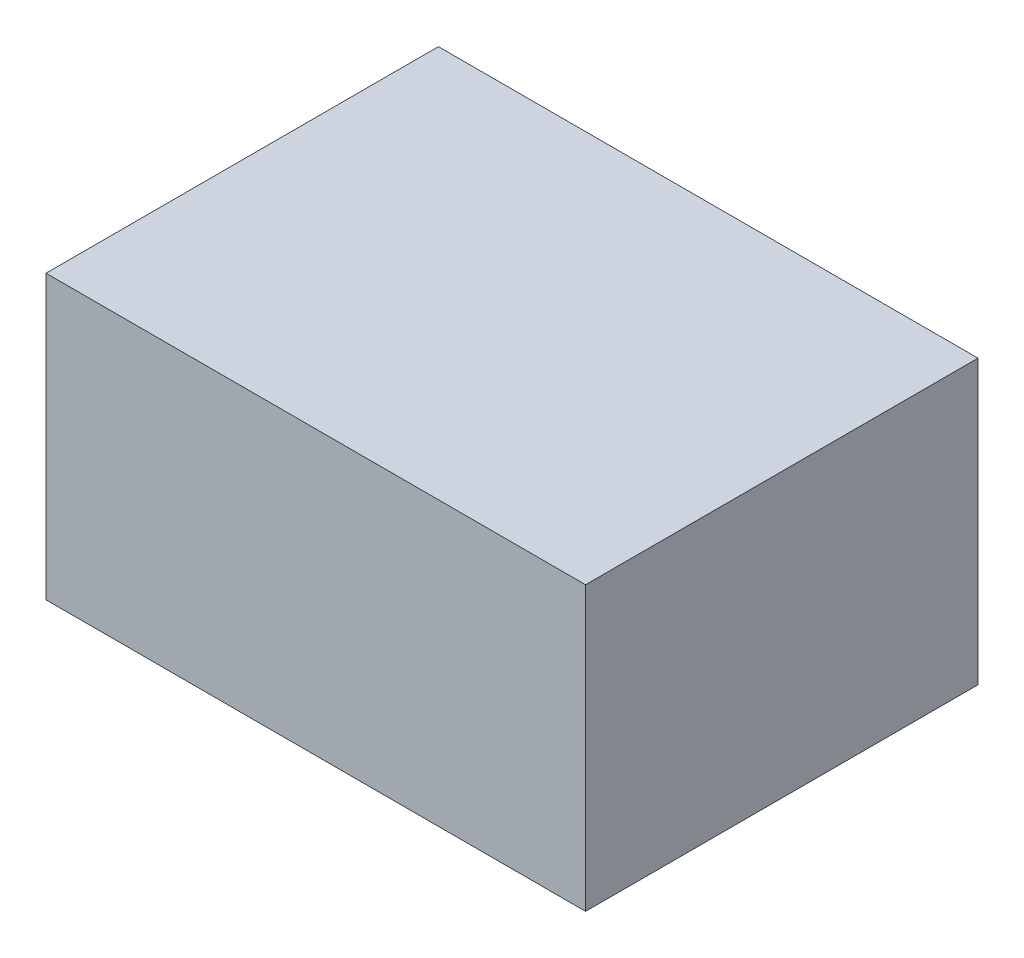
ISO-10303-21;
HEADER;
FILE_DESCRIPTION(('STEP AP214'),'2;1');
FILE_NAME('part.step','',(''),(''),'','','');
FILE_SCHEMA(('AUTOMOTIVE_DESIGN { 1 0 10303 214 1 1 1 1 }'));
ENDSEC;
DATA;
#1=APPLICATION_CONTEXT('core data for automotive mechanical design processes');
#2=APPLICATION_PROTOCOL_DEFINITION('international standard','automotive_design',2000,#1);
#3=PRODUCT_CONTEXT('',#1,'mechanical');
#4=PRODUCT('Part','Part','',(#3));
#5=PRODUCT_RELATED_PRODUCT_CATEGORY('part','',(#4));
#6=PRODUCT_DEFINITION_FORMATION('','',#4);
#7=PRODUCT_DEFINITION_CONTEXT('part definition',#1,'design');
#8=PRODUCT_DEFINITION('design','',#6,#7);
#9=PRODUCT_DEFINITION_SHAPE('','',#8);
#10=(LENGTH_UNIT() NAMED_UNIT(*) SI_UNIT(.MILLI.,.METRE.));
#11=(NAMED_UNIT(*) PLANE_ANGLE_UNIT() SI_UNIT($,.RADIAN.));
#12=(NAMED_UNIT(*) SI_UNIT($,.STERADIAN.) SOLID_ANGLE_UNIT());
#13=UNCERTAINTY_MEASURE_WITH_UNIT(LENGTH_MEASURE(1.E-05),#10,'distance_accuracy_value','');
#14=(GEOMETRIC_REPRESENTATION_CONTEXT(3) GLOBAL_UNCERTAINTY_ASSIGNED_CONTEXT((#13)) GLOBAL_UNIT_ASSIGNED_CONTEXT((#10,
#11,#12)) REPRESENTATION_CONTEXT('',''));
#15=CARTESIAN_POINT('',(0.,0.,0.));
#16=DIRECTION('',(0.,0.,1.));
#17=DIRECTION('',(1.,0.,0.));
#18=AXIS2_PLACEMENT_3D('',#15,#16,#17);
#19=CARTESIAN_POINT('',(0.,0.,240.));
#20=DIRECTION('',(1.,0.,0.));
#21=DIRECTION('',(0.,0.,-1.));
#22=AXIS2_PLACEMENT_3D('',#19,#20,#21);
#23=PLANE('',#22);
#24=DIRECTION('',(0.,-1.,0.));
#25=VECTOR('',#24,1.);
#26=CARTESIAN_POINT('',(0.,0.,0.));
#27=LINE('',#26,#25);
#28=CARTESIAN_POINT('',(0.,173.,0.));
#29=VERTEX_POINT('',#28);
#30=CARTESIAN_POINT('',(0.,0.,0.));
#31=VERTEX_POINT('',#30);
#32=EDGE_CURVE('E96',#29,#31,#27,.T.);
#33=ORIENTED_EDGE('',*,*,#32,.T.);
#34=DIRECTION('',(0.,0.,-1.));
#35=VECTOR('',#34,1.);
#36=CARTESIAN_POINT('',(0.,0.,240.));
#37=LINE('',#36,#35);
#38=CARTESIAN_POINT('',(0.,0.,240.));
#39=VERTEX_POINT('',#38);
#40=EDGE_CURVE('E11',#39,#31,#37,.T.);
#41=ORIENTED_EDGE('',*,*,#40,.F.);
#42=DIRECTION('',(0.,-1.,0.));
#43=VECTOR('',#42,1.);
#44=CARTESIAN_POINT('',(0.,0.,240.));
#45=LINE('',#44,#43);
#46=CARTESIAN_POINT('',(0.,173.,240.));
#47=VERTEX_POINT('',#46);
#48=EDGE_CURVE('E84',#47,#39,#45,.T.);
#49=ORIENTED_EDGE('',*,*,#48,.F.);
#50=DIRECTION('',(0.,0.,-1.));
#51=VECTOR('',#50,1.);
#52=CARTESIAN_POINT('',(0.,173.,240.));
#53=LINE('',#52,#51);
#54=EDGE_CURVE('E92',#47,#29,#53,.T.);
#55=ORIENTED_EDGE('',*,*,#54,.T.);
#56=EDGE_LOOP('',(#33,#41,#49,#55));
#57=FACE_BOUND('',#56,.T.);
#58=ADVANCED_FACE('F33',(#57),#23,.F.);
#59=CARTESIAN_POINT('',(0.,0.,240.));
#60=DIRECTION('',(0.,1.,0.));
#61=DIRECTION('',(0.,0.,1.));
#62=AXIS2_PLACEMENT_3D('',#59,#60,#61);
#63=PLANE('',#62);
#64=DIRECTION('',(1.,0.,0.));
#65=VECTOR('',#64,1.);
#66=CARTESIAN_POINT('',(0.,0.,0.));
#67=LINE('',#66,#65);
#68=CARTESIAN_POINT('',(330.,0.,0.));
#69=VERTEX_POINT('',#68);
#70=EDGE_CURVE('E88',#31,#69,#67,.T.);
#71=ORIENTED_EDGE('',*,*,#70,.T.);
#72=DIRECTION('',(0.,0.,-1.));
#73=VECTOR('',#72,1.);
#74=CARTESIAN_POINT('',(330.,0.,240.));
#75=LINE('',#74,#73);
#76=CARTESIAN_POINT('',(330.,0.,240.));
#77=VERTEX_POINT('',#76);
#78=EDGE_CURVE('E41',#77,#69,#75,.T.);
#79=ORIENTED_EDGE('',*,*,#78,.F.);
#80=DIRECTION('',(1.,0.,0.));
#81=VECTOR('',#80,1.);
#82=CARTESIAN_POINT('',(0.,0.,240.));
#83=LINE('',#82,#81);
#84=EDGE_CURVE('E79',#39,#77,#83,.T.);
#85=ORIENTED_EDGE('',*,*,#84,.F.);
#86=ORIENTED_EDGE('',*,*,#40,.T.);
#87=EDGE_LOOP('',(#71,#79,#85,#86));
#88=FACE_BOUND('',#87,.T.);
#89=ADVANCED_FACE('F87',(#88),#63,.F.);
#90=CARTESIAN_POINT('',(330.,0.,240.));
#91=DIRECTION('',(-1.,0.,0.));
#92=DIRECTION('',(0.,-1.,0.));
#93=AXIS2_PLACEMENT_3D('',#90,#91,#92);
#94=PLANE('',#93);
#95=DIRECTION('',(0.,1.,0.));
#96=VECTOR('',#95,1.);
#97=CARTESIAN_POINT('',(330.,0.,0.));
#98=LINE('',#97,#96);
#99=CARTESIAN_POINT('',(330.,173.,0.));
#100=VERTEX_POINT('',#99);
#101=EDGE_CURVE('E66',#69,#100,#98,.T.);
#102=ORIENTED_EDGE('',*,*,#101,.T.);
#103=DIRECTION('',(0.,0.,-1.));
#104=VECTOR('',#103,1.);
#105=CARTESIAN_POINT('',(330.,173.,240.));
#106=LINE('',#105,#104);
#107=CARTESIAN_POINT('',(330.,173.,240.));
#108=VERTEX_POINT('',#107);
#109=EDGE_CURVE('E89',#108,#100,#106,.T.);
#110=ORIENTED_EDGE('',*,*,#109,.F.);
#111=DIRECTION('',(0.,1.,0.));
#112=VECTOR('',#111,1.);
#113=CARTESIAN_POINT('',(330.,0.,240.));
#114=LINE('',#113,#112);
#115=EDGE_CURVE('E82',#77,#108,#114,.T.);
#116=ORIENTED_EDGE('',*,*,#115,.F.);
#117=ORIENTED_EDGE('',*,*,#78,.T.);
#118=EDGE_LOOP('',(#102,#110,#116,#117));
#119=FACE_BOUND('',#118,.T.);
#120=ADVANCED_FACE('F90',(#119),#94,.F.);
#121=CARTESIAN_POINT('',(0.,173.,240.));
#122=DIRECTION('',(0.,-1.,0.));
#123=DIRECTION('',(0.,0.,-1.));
#124=AXIS2_PLACEMENT_3D('',#121,#122,#123);
#125=PLANE('',#124);
#126=DIRECTION('',(-1.,0.,0.));
#127=VECTOR('',#126,1.);
#128=CARTESIAN_POINT('',(0.,173.,0.));
#129=LINE('',#128,#127);
#130=EDGE_CURVE('E72',#100,#29,#129,.T.);
#131=ORIENTED_EDGE('',*,*,#130,.T.);
#132=ORIENTED_EDGE('',*,*,#54,.F.);
#133=DIRECTION('',(-1.,0.,0.));
#134=VECTOR('',#133,1.);
#135=CARTESIAN_POINT('',(0.,173.,240.));
#136=LINE('',#135,#134);
#137=EDGE_CURVE('E49',#108,#47,#136,.T.);
#138=ORIENTED_EDGE('',*,*,#137,.F.);
#139=ORIENTED_EDGE('',*,*,#109,.T.);
#140=EDGE_LOOP('',(#131,#132,#138,#139));
#141=FACE_BOUND('',#140,.T.);
#142=ADVANCED_FACE('F103',(#141),#125,.F.);
#143=CARTESIAN_POINT('',(0.,173.,240.));
#144=DIRECTION('',(0.,0.,-1.));
#145=DIRECTION('',(-1.,0.,0.));
#146=AXIS2_PLACEMENT_3D('',#143,#144,#145);
#147=PLANE('',#146);
#148=ORIENTED_EDGE('',*,*,#48,.T.);
#149=ORIENTED_EDGE('',*,*,#84,.T.);
#150=ORIENTED_EDGE('',*,*,#115,.T.);
#151=ORIENTED_EDGE('',*,*,#137,.T.);
#152=EDGE_LOOP('',(#148,#149,#150,#151));
#153=FACE_BOUND('',#152,.T.);
#154=ADVANCED_FACE('F80',(#153),#147,.F.);
#155=CARTESIAN_POINT('',(0.,173.,0.));
#156=DIRECTION('',(0.,0.,-1.));
#157=DIRECTION('',(-1.,0.,0.));
#158=AXIS2_PLACEMENT_3D('',#155,#156,#157);
#159=PLANE('',#158);
#160=ORIENTED_EDGE('',*,*,#32,.F.);
#161=ORIENTED_EDGE('',*,*,#130,.F.);
#162=ORIENTED_EDGE('',*,*,#101,.F.);
#163=ORIENTED_EDGE('',*,*,#70,.F.);
#164=EDGE_LOOP('',(#160,#161,#162,#163));
#165=FACE_BOUND('',#164,.T.);
#166=ADVANCED_FACE('F106',(#165),#159,.T.);
#167=CLOSED_SHELL('',(#58,#89,#120,#142,#154,#166));
#168=MANIFOLD_SOLID_BREP('B2',#167);
#169=ADVANCED_BREP_SHAPE_REPRESENTATION('',(#18,#168),#14);
#170=SHAPE_DEFINITION_REPRESENTATION(#9,#169);
ENDSEC;
END-ISO-10303-21;
